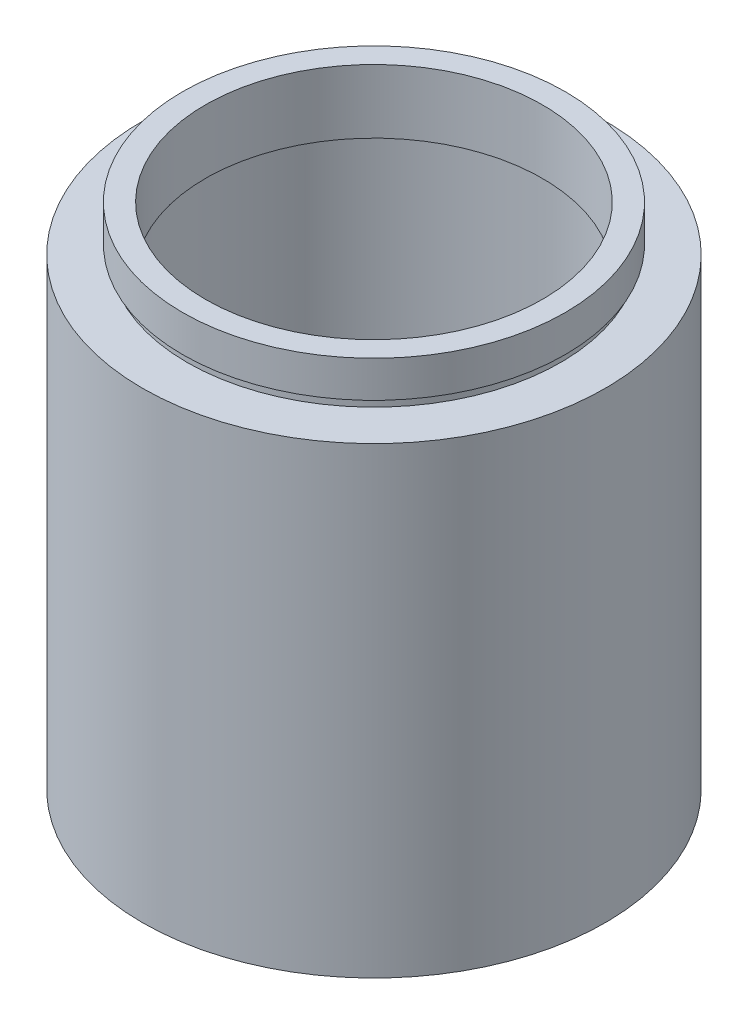
ISO-10303-21;
HEADER;
FILE_DESCRIPTION(('STEP AP214'),'2;1');
FILE_NAME('part.step','',(''),(''),'','','');
FILE_SCHEMA(('AUTOMOTIVE_DESIGN { 1 0 10303 214 1 1 1 1 }'));
ENDSEC;
DATA;
#1=APPLICATION_CONTEXT('core data for automotive mechanical design processes');
#2=APPLICATION_PROTOCOL_DEFINITION('international standard','automotive_design',2000,#1);
#3=PRODUCT_CONTEXT('',#1,'mechanical');
#4=PRODUCT('Part','Part','',(#3));
#5=PRODUCT_RELATED_PRODUCT_CATEGORY('part','',(#4));
#6=PRODUCT_DEFINITION_FORMATION('','',#4);
#7=PRODUCT_DEFINITION_CONTEXT('part definition',#1,'design');
#8=PRODUCT_DEFINITION('design','',#6,#7);
#9=PRODUCT_DEFINITION_SHAPE('','',#8);
#10=(LENGTH_UNIT() NAMED_UNIT(*) SI_UNIT(.MILLI.,.METRE.));
#11=(NAMED_UNIT(*) PLANE_ANGLE_UNIT() SI_UNIT($,.RADIAN.));
#12=(NAMED_UNIT(*) SI_UNIT($,.STERADIAN.) SOLID_ANGLE_UNIT());
#13=UNCERTAINTY_MEASURE_WITH_UNIT(LENGTH_MEASURE(1.E-05),#10,'distance_accuracy_value','');
#14=(GEOMETRIC_REPRESENTATION_CONTEXT(3) GLOBAL_UNCERTAINTY_ASSIGNED_CONTEXT((#13)) GLOBAL_UNIT_ASSIGNED_CONTEXT((#10,
#11,#12)) REPRESENTATION_CONTEXT('',''));
#15=CARTESIAN_POINT('',(0.,0.,0.));
#16=DIRECTION('',(0.,0.,1.));
#17=DIRECTION('',(1.,0.,0.));
#18=AXIS2_PLACEMENT_3D('',#15,#16,#17);
#19=CARTESIAN_POINT('',(0.,161.376166943427,0.));
#20=DIRECTION('',(0.,1.,0.));
#21=DIRECTION('',(0.,0.,1.));
#22=AXIS2_PLACEMENT_3D('',#19,#20,#21);
#23=CYLINDRICAL_SURFACE('',#22,18.5);
#24=CARTESIAN_POINT('',(0.,48.8,0.));
#25=DIRECTION('',(0.,1.,0.));
#26=DIRECTION('',(0.,0.,1.));
#27=AXIS2_PLACEMENT_3D('',#24,#25,#26);
#28=CIRCLE('',#27,18.5);
#29=CARTESIAN_POINT('',(0.,48.8,18.5));
#30=VERTEX_POINT('',#29);
#31=EDGE_CURVE('E77',#30,#30,#28,.T.);
#32=ORIENTED_EDGE('',*,*,#31,.F.);
#33=EDGE_LOOP('',(#32));
#34=FACE_BOUND('',#33,.T.);
#35=CARTESIAN_POINT('',(0.,55.8,0.));
#36=DIRECTION('',(0.,1.,0.));
#37=DIRECTION('',(0.,0.,1.));
#38=AXIS2_PLACEMENT_3D('',#35,#36,#37);
#39=CIRCLE('',#38,18.5);
#40=CARTESIAN_POINT('',(0.,55.8,18.5));
#41=VERTEX_POINT('',#40);
#42=EDGE_CURVE('E10',#41,#41,#39,.T.);
#43=ORIENTED_EDGE('',*,*,#42,.T.);
#44=EDGE_LOOP('',(#43));
#45=FACE_BOUND('',#44,.T.);
#46=ADVANCED_FACE('F37',(#34,#45),#23,.F.);
#47=CARTESIAN_POINT('',(18.5,55.8,0.));
#48=DIRECTION('',(0.,-1.,0.));
#49=DIRECTION('',(0.,0.,-1.));
#50=AXIS2_PLACEMENT_3D('',#47,#48,#49);
#51=PLANE('',#50);
#52=ORIENTED_EDGE('',*,*,#42,.F.);
#53=EDGE_LOOP('',(#52));
#54=FACE_BOUND('',#53,.T.);
#55=CARTESIAN_POINT('',(0.,55.8,0.));
#56=DIRECTION('',(0.,1.,0.));
#57=DIRECTION('',(0.,0.,1.));
#58=AXIS2_PLACEMENT_3D('',#55,#56,#57);
#59=CIRCLE('',#58,21.);
#60=CARTESIAN_POINT('',(0.,55.8,21.));
#61=VERTEX_POINT('',#60);
#62=EDGE_CURVE('E43',#61,#61,#59,.T.);
#63=ORIENTED_EDGE('',*,*,#62,.T.);
#64=EDGE_LOOP('',(#63));
#65=FACE_BOUND('',#64,.T.);
#66=ADVANCED_FACE('F84',(#54,#65),#51,.F.);
#67=CARTESIAN_POINT('',(0.,161.376166943427,0.));
#68=DIRECTION('',(0.,1.,0.));
#69=DIRECTION('',(0.,0.,1.));
#70=AXIS2_PLACEMENT_3D('',#67,#68,#69);
#71=CYLINDRICAL_SURFACE('',#70,21.);
#72=ORIENTED_EDGE('',*,*,#62,.F.);
#73=EDGE_LOOP('',(#72));
#74=FACE_BOUND('',#73,.T.);
#75=CARTESIAN_POINT('',(0.,51.8,0.));
#76=DIRECTION('',(0.,1.,0.));
#77=DIRECTION('',(0.,0.,1.));
#78=AXIS2_PLACEMENT_3D('',#75,#76,#77);
#79=CIRCLE('',#78,21.);
#80=CARTESIAN_POINT('',(0.,51.8,21.));
#81=VERTEX_POINT('',#80);
#82=EDGE_CURVE('E47',#81,#81,#79,.T.);
#83=ORIENTED_EDGE('',*,*,#82,.T.);
#84=EDGE_LOOP('',(#83));
#85=FACE_BOUND('',#84,.T.);
#86=ADVANCED_FACE('F88',(#74,#85),#71,.T.);
#87=CARTESIAN_POINT('',(21.,51.8,0.));
#88=DIRECTION('',(0.,1.,0.));
#89=DIRECTION('',(0.,0.,1.));
#90=AXIS2_PLACEMENT_3D('',#87,#88,#89);
#91=PLANE('',#90);
#92=ORIENTED_EDGE('',*,*,#82,.F.);
#93=EDGE_LOOP('',(#92));
#94=FACE_BOUND('',#93,.T.);
#95=CARTESIAN_POINT('',(0.,51.8,0.));
#96=DIRECTION('',(0.,1.,0.));
#97=DIRECTION('',(0.,0.,1.));
#98=AXIS2_PLACEMENT_3D('',#95,#96,#97);
#99=CIRCLE('',#98,20.5);
#100=CARTESIAN_POINT('',(0.,51.8,20.5));
#101=VERTEX_POINT('',#100);
#102=EDGE_CURVE('E51',#101,#101,#99,.T.);
#103=ORIENTED_EDGE('',*,*,#102,.T.);
#104=EDGE_LOOP('',(#103));
#105=FACE_BOUND('',#104,.T.);
#106=ADVANCED_FACE('F93',(#94,#105),#91,.F.);
#107=CARTESIAN_POINT('',(0.,161.376166943427,0.));
#108=DIRECTION('',(0.,1.,0.));
#109=DIRECTION('',(0.,0.,1.));
#110=AXIS2_PLACEMENT_3D('',#107,#108,#109);
#111=CYLINDRICAL_SURFACE('',#110,20.5);
#112=ORIENTED_EDGE('',*,*,#102,.F.);
#113=EDGE_LOOP('',(#112));
#114=FACE_BOUND('',#113,.T.);
#115=CARTESIAN_POINT('',(0.,50.8,0.));
#116=DIRECTION('',(0.,1.,0.));
#117=DIRECTION('',(0.,0.,1.));
#118=AXIS2_PLACEMENT_3D('',#115,#116,#117);
#119=CIRCLE('',#118,20.5);
#120=CARTESIAN_POINT('',(0.,50.8,20.5));
#121=VERTEX_POINT('',#120);
#122=EDGE_CURVE('E56',#121,#121,#119,.T.);
#123=ORIENTED_EDGE('',*,*,#122,.T.);
#124=EDGE_LOOP('',(#123));
#125=FACE_BOUND('',#124,.T.);
#126=ADVANCED_FACE('F99',(#114,#125),#111,.T.);
#127=CARTESIAN_POINT('',(20.5,50.8,0.));
#128=DIRECTION('',(0.,-1.,0.));
#129=DIRECTION('',(0.,0.,-1.));
#130=AXIS2_PLACEMENT_3D('',#127,#128,#129);
#131=PLANE('',#130);
#132=ORIENTED_EDGE('',*,*,#122,.F.);
#133=EDGE_LOOP('',(#132));
#134=FACE_BOUND('',#133,.T.);
#135=CARTESIAN_POINT('',(0.,50.8,0.));
#136=DIRECTION('',(0.,1.,0.));
#137=DIRECTION('',(0.,0.,1.));
#138=AXIS2_PLACEMENT_3D('',#135,#136,#137);
#139=CIRCLE('',#138,25.4);
#140=CARTESIAN_POINT('',(0.,50.8,25.4));
#141=VERTEX_POINT('',#140);
#142=EDGE_CURVE('E59',#141,#141,#139,.T.);
#143=ORIENTED_EDGE('',*,*,#142,.T.);
#144=EDGE_LOOP('',(#143));
#145=FACE_BOUND('',#144,.T.);
#146=ADVANCED_FACE('F103',(#134,#145),#131,.F.);
#147=CARTESIAN_POINT('',(0.,161.376166943427,0.));
#148=DIRECTION('',(0.,1.,0.));
#149=DIRECTION('',(0.,0.,1.));
#150=AXIS2_PLACEMENT_3D('',#147,#148,#149);
#151=CYLINDRICAL_SURFACE('',#150,25.4);
#152=ORIENTED_EDGE('',*,*,#142,.F.);
#153=EDGE_LOOP('',(#152));
#154=FACE_BOUND('',#153,.T.);
#155=CARTESIAN_POINT('',(0.,0.,0.));
#156=DIRECTION('',(0.,1.,0.));
#157=DIRECTION('',(0.,0.,1.));
#158=AXIS2_PLACEMENT_3D('',#155,#156,#157);
#159=CIRCLE('',#158,25.4);
#160=CARTESIAN_POINT('',(0.,0.,25.4));
#161=VERTEX_POINT('',#160);
#162=EDGE_CURVE('E62',#161,#161,#159,.T.);
#163=ORIENTED_EDGE('',*,*,#162,.T.);
#164=EDGE_LOOP('',(#163));
#165=FACE_BOUND('',#164,.T.);
#166=ADVANCED_FACE('F107',(#154,#165),#151,.T.);
#167=CARTESIAN_POINT('',(25.4,0.,0.));
#168=DIRECTION('',(0.,1.,0.));
#169=DIRECTION('',(0.,0.,1.));
#170=AXIS2_PLACEMENT_3D('',#167,#168,#169);
#171=PLANE('',#170);
#172=ORIENTED_EDGE('',*,*,#162,.F.);
#173=EDGE_LOOP('',(#172));
#174=FACE_BOUND('',#173,.T.);
#175=CARTESIAN_POINT('',(0.,0.,0.));
#176=DIRECTION('',(0.,1.,0.));
#177=DIRECTION('',(0.,0.,1.));
#178=AXIS2_PLACEMENT_3D('',#175,#176,#177);
#179=CIRCLE('',#178,20.5);
#180=CARTESIAN_POINT('',(0.,0.,20.5));
#181=VERTEX_POINT('',#180);
#182=EDGE_CURVE('E65',#181,#181,#179,.T.);
#183=ORIENTED_EDGE('',*,*,#182,.T.);
#184=EDGE_LOOP('',(#183));
#185=FACE_BOUND('',#184,.T.);
#186=ADVANCED_FACE('F111',(#174,#185),#171,.F.);
#187=CARTESIAN_POINT('',(0.,161.376166943427,0.));
#188=DIRECTION('',(0.,1.,0.));
#189=DIRECTION('',(0.,0.,1.));
#190=AXIS2_PLACEMENT_3D('',#187,#188,#189);
#191=CYLINDRICAL_SURFACE('',#190,20.5);
#192=ORIENTED_EDGE('',*,*,#182,.F.);
#193=EDGE_LOOP('',(#192));
#194=FACE_BOUND('',#193,.T.);
#195=CARTESIAN_POINT('',(0.,47.8,0.));
#196=DIRECTION('',(0.,1.,0.));
#197=DIRECTION('',(0.,0.,1.));
#198=AXIS2_PLACEMENT_3D('',#195,#196,#197);
#199=CIRCLE('',#198,20.5);
#200=CARTESIAN_POINT('',(0.,47.8,20.5));
#201=VERTEX_POINT('',#200);
#202=EDGE_CURVE('E68',#201,#201,#199,.T.);
#203=ORIENTED_EDGE('',*,*,#202,.T.);
#204=EDGE_LOOP('',(#203));
#205=FACE_BOUND('',#204,.T.);
#206=ADVANCED_FACE('F115',(#194,#205),#191,.F.);
#207=CARTESIAN_POINT('',(20.5,47.8,0.));
#208=DIRECTION('',(0.,-1.,0.));
#209=DIRECTION('',(0.,0.,-1.));
#210=AXIS2_PLACEMENT_3D('',#207,#208,#209);
#211=PLANE('',#210);
#212=ORIENTED_EDGE('',*,*,#202,.F.);
#213=EDGE_LOOP('',(#212));
#214=FACE_BOUND('',#213,.T.);
#215=CARTESIAN_POINT('',(0.,47.8,0.));
#216=DIRECTION('',(0.,1.,0.));
#217=DIRECTION('',(0.,0.,1.));
#218=AXIS2_PLACEMENT_3D('',#215,#216,#217);
#219=CIRCLE('',#218,21.1);
#220=CARTESIAN_POINT('',(0.,47.8,21.1));
#221=VERTEX_POINT('',#220);
#222=EDGE_CURVE('E71',#221,#221,#219,.T.);
#223=ORIENTED_EDGE('',*,*,#222,.T.);
#224=EDGE_LOOP('',(#223));
#225=FACE_BOUND('',#224,.T.);
#226=ADVANCED_FACE('F119',(#214,#225),#211,.F.);
#227=CARTESIAN_POINT('',(0.,161.376166943427,0.));
#228=DIRECTION('',(0.,1.,0.));
#229=DIRECTION('',(0.,0.,1.));
#230=AXIS2_PLACEMENT_3D('',#227,#228,#229);
#231=CYLINDRICAL_SURFACE('',#230,21.1);
#232=ORIENTED_EDGE('',*,*,#222,.F.);
#233=EDGE_LOOP('',(#232));
#234=FACE_BOUND('',#233,.T.);
#235=CARTESIAN_POINT('',(0.,48.8,0.));
#236=DIRECTION('',(0.,1.,0.));
#237=DIRECTION('',(0.,0.,1.));
#238=AXIS2_PLACEMENT_3D('',#235,#236,#237);
#239=CIRCLE('',#238,21.1);
#240=CARTESIAN_POINT('',(0.,48.8,21.1));
#241=VERTEX_POINT('',#240);
#242=EDGE_CURVE('E74',#241,#241,#239,.T.);
#243=ORIENTED_EDGE('',*,*,#242,.T.);
#244=EDGE_LOOP('',(#243));
#245=FACE_BOUND('',#244,.T.);
#246=ADVANCED_FACE('F123',(#234,#245),#231,.F.);
#247=CARTESIAN_POINT('',(21.1,48.8,0.));
#248=DIRECTION('',(0.,1.,0.));
#249=DIRECTION('',(0.,0.,1.));
#250=AXIS2_PLACEMENT_3D('',#247,#248,#249);
#251=PLANE('',#250);
#252=ORIENTED_EDGE('',*,*,#242,.F.);
#253=EDGE_LOOP('',(#252));
#254=FACE_BOUND('',#253,.T.);
#255=ORIENTED_EDGE('',*,*,#31,.T.);
#256=EDGE_LOOP('',(#255));
#257=FACE_BOUND('',#256,.T.);
#258=ADVANCED_FACE('F81',(#254,#257),#251,.F.);
#259=CLOSED_SHELL('',(#46,#66,#86,#106,#126,#146,#166,#186,#206,#226,#246,#258));
#260=MANIFOLD_SOLID_BREP('B2',#259);
#261=ADVANCED_BREP_SHAPE_REPRESENTATION('',(#18,#260),#14);
#262=SHAPE_DEFINITION_REPRESENTATION(#9,#261);
ENDSEC;
END-ISO-10303-21;
